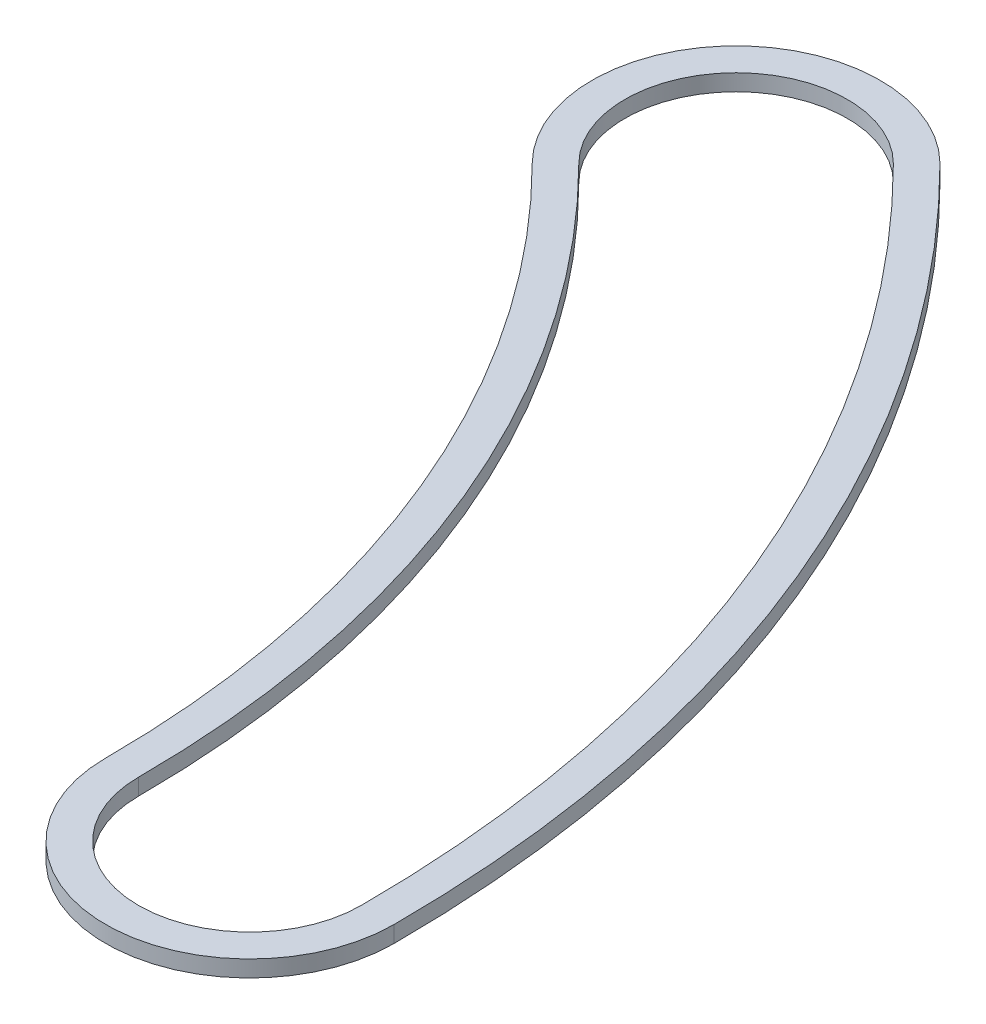
ISO-10303-21;
HEADER;
FILE_DESCRIPTION(('STEP AP214'),'2;1');
FILE_NAME('part.step','',(''),(''),'','','');
FILE_SCHEMA(('AUTOMOTIVE_DESIGN { 1 0 10303 214 1 1 1 1 }'));
ENDSEC;
DATA;
#1=APPLICATION_CONTEXT('core data for automotive mechanical design processes');
#2=APPLICATION_PROTOCOL_DEFINITION('international standard','automotive_design',2000,#1);
#3=PRODUCT_CONTEXT('',#1,'mechanical');
#4=PRODUCT('Part','Part','',(#3));
#5=PRODUCT_RELATED_PRODUCT_CATEGORY('part','',(#4));
#6=PRODUCT_DEFINITION_FORMATION('','',#4);
#7=PRODUCT_DEFINITION_CONTEXT('part definition',#1,'design');
#8=PRODUCT_DEFINITION('design','',#6,#7);
#9=PRODUCT_DEFINITION_SHAPE('','',#8);
#10=(LENGTH_UNIT() NAMED_UNIT(*) SI_UNIT(.MILLI.,.METRE.));
#11=(NAMED_UNIT(*) PLANE_ANGLE_UNIT() SI_UNIT($,.RADIAN.));
#12=(NAMED_UNIT(*) SI_UNIT($,.STERADIAN.) SOLID_ANGLE_UNIT());
#13=UNCERTAINTY_MEASURE_WITH_UNIT(LENGTH_MEASURE(1.E-05),#10,'distance_accuracy_value','');
#14=(GEOMETRIC_REPRESENTATION_CONTEXT(3) GLOBAL_UNCERTAINTY_ASSIGNED_CONTEXT((#13)) GLOBAL_UNIT_ASSIGNED_CONTEXT((#10,
#11,#12)) REPRESENTATION_CONTEXT('',''));
#15=CARTESIAN_POINT('',(0.,0.,0.));
#16=DIRECTION('',(0.,0.,1.));
#17=DIRECTION('',(1.,0.,0.));
#18=AXIS2_PLACEMENT_3D('',#15,#16,#17);
#19=CARTESIAN_POINT('',(18.0975,0.508,0.));
#20=DIRECTION('',(0.,1.,0.));
#21=DIRECTION('',(0.,0.,1.));
#22=AXIS2_PLACEMENT_3D('',#19,#20,#21);
#23=PLANE('',#22);
#24=CARTESIAN_POINT('',(36.195,0.508,0.));
#25=DIRECTION('',(0.,1.,0.));
#26=DIRECTION('',(0.,0.,1.));
#27=AXIS2_PLACEMENT_3D('',#24,#25,#26);
#28=CIRCLE('',#27,4.445);
#29=CARTESIAN_POINT('',(31.75,0.508,0.));
#30=VERTEX_POINT('',#29);
#31=CARTESIAN_POINT('',(40.64,0.508,0.));
#32=VERTEX_POINT('',#31);
#33=EDGE_CURVE('E133',#30,#32,#28,.T.);
#34=ORIENTED_EDGE('',*,*,#33,.T.);
#35=CARTESIAN_POINT('',(0.,0.508,0.));
#36=DIRECTION('',(0.,1.,0.));
#37=DIRECTION('',(0.,0.,1.));
#38=AXIS2_PLACEMENT_3D('',#35,#36,#37);
#39=CIRCLE('',#38,40.64);
#40=CARTESIAN_POINT('',(28.7368195874212,0.508,-28.7368195874213));
#41=VERTEX_POINT('',#40);
#42=EDGE_CURVE('E136',#32,#41,#39,.T.);
#43=ORIENTED_EDGE('',*,*,#42,.T.);
#44=CARTESIAN_POINT('',(25.593729945047,0.508,-25.5937299450471));
#45=DIRECTION('',(0.,1.,0.));
#46=DIRECTION('',(0.,0.,1.));
#47=AXIS2_PLACEMENT_3D('',#44,#45,#46);
#48=CIRCLE('',#47,4.445);
#49=CARTESIAN_POINT('',(22.4506403026728,0.508,-22.4506403026729));
#50=VERTEX_POINT('',#49);
#51=EDGE_CURVE('E139',#41,#50,#48,.T.);
#52=ORIENTED_EDGE('',*,*,#51,.T.);
#53=CARTESIAN_POINT('',(0.,0.508,0.));
#54=DIRECTION('',(0.,-1.,0.));
#55=DIRECTION('',(0.,0.,1.));
#56=AXIS2_PLACEMENT_3D('',#53,#54,#55);
#57=CIRCLE('',#56,31.75);
#58=EDGE_CURVE('E141',#50,#30,#57,.T.);
#59=ORIENTED_EDGE('',*,*,#58,.T.);
#60=EDGE_LOOP('',(#34,#43,#52,#59));
#61=FACE_BOUND('',#60,.T.);
#62=CARTESIAN_POINT('',(0.,0.508,0.));
#63=DIRECTION('',(0.,1.,0.));
#64=DIRECTION('',(0.,0.,1.));
#65=AXIS2_PLACEMENT_3D('',#62,#63,#64);
#66=CIRCLE('',#65,39.624);
#67=CARTESIAN_POINT('',(39.624,0.508,0.));
#68=VERTEX_POINT('',#67);
#69=CARTESIAN_POINT('',(28.0183990977357,0.508,-28.0183990977358));
#70=VERTEX_POINT('',#69);
#71=EDGE_CURVE('E105',#68,#70,#66,.T.);
#72=ORIENTED_EDGE('',*,*,#71,.F.);
#73=CARTESIAN_POINT('',(36.195,0.508,0.));
#74=DIRECTION('',(0.,1.,0.));
#75=DIRECTION('',(0.,0.,1.));
#76=AXIS2_PLACEMENT_3D('',#73,#74,#75);
#77=CIRCLE('',#76,3.429);
#78=CARTESIAN_POINT('',(32.766,0.508,0.));
#79=VERTEX_POINT('',#78);
#80=EDGE_CURVE('E97',#79,#68,#77,.T.);
#81=ORIENTED_EDGE('',*,*,#80,.F.);
#82=CARTESIAN_POINT('',(0.,0.508,0.));
#83=DIRECTION('',(0.,-1.,0.));
#84=DIRECTION('',(0.,0.,1.));
#85=AXIS2_PLACEMENT_3D('',#82,#83,#84);
#86=CIRCLE('',#85,32.766);
#87=CARTESIAN_POINT('',(23.1690607923584,0.508,-23.1690607923585));
#88=VERTEX_POINT('',#87);
#89=EDGE_CURVE('E119',#88,#79,#86,.T.);
#90=ORIENTED_EDGE('',*,*,#89,.F.);
#91=CARTESIAN_POINT('',(25.593729945047,0.508,-25.5937299450471));
#92=DIRECTION('',(0.,1.,0.));
#93=DIRECTION('',(0.,0.,1.));
#94=AXIS2_PLACEMENT_3D('',#91,#92,#93);
#95=CIRCLE('',#94,3.429);
#96=EDGE_CURVE('E117',#70,#88,#95,.T.);
#97=ORIENTED_EDGE('',*,*,#96,.F.);
#98=EDGE_LOOP('',(#72,#81,#90,#97));
#99=FACE_BOUND('',#98,.T.);
#100=ADVANCED_FACE('F32',(#61,#99),#23,.T.);
#101=CARTESIAN_POINT('',(18.0975,0.,0.));
#102=DIRECTION('',(0.,1.,0.));
#103=DIRECTION('',(0.,0.,1.));
#104=AXIS2_PLACEMENT_3D('',#101,#102,#103);
#105=PLANE('',#104);
#106=CARTESIAN_POINT('',(36.195,0.,0.));
#107=DIRECTION('',(0.,1.,0.));
#108=DIRECTION('',(0.,0.,1.));
#109=AXIS2_PLACEMENT_3D('',#106,#107,#108);
#110=CIRCLE('',#109,4.445);
#111=CARTESIAN_POINT('',(31.75,0.,0.));
#112=VERTEX_POINT('',#111);
#113=CARTESIAN_POINT('',(40.64,0.,0.));
#114=VERTEX_POINT('',#113);
#115=EDGE_CURVE('E113',#112,#114,#110,.T.);
#116=ORIENTED_EDGE('',*,*,#115,.F.);
#117=CARTESIAN_POINT('',(0.,0.,0.));
#118=DIRECTION('',(0.,-1.,0.));
#119=DIRECTION('',(0.,0.,1.));
#120=AXIS2_PLACEMENT_3D('',#117,#118,#119);
#121=CIRCLE('',#120,31.75);
#122=CARTESIAN_POINT('',(22.4506403026728,0.,-22.4506403026729));
#123=VERTEX_POINT('',#122);
#124=EDGE_CURVE('E137',#123,#112,#121,.T.);
#125=ORIENTED_EDGE('',*,*,#124,.F.);
#126=CARTESIAN_POINT('',(25.593729945047,0.,-25.5937299450471));
#127=DIRECTION('',(0.,1.,0.));
#128=DIRECTION('',(0.,0.,1.));
#129=AXIS2_PLACEMENT_3D('',#126,#127,#128);
#130=CIRCLE('',#129,4.445);
#131=CARTESIAN_POINT('',(28.7368195874212,0.,-28.7368195874213));
#132=VERTEX_POINT('',#131);
#133=EDGE_CURVE('E148',#132,#123,#130,.T.);
#134=ORIENTED_EDGE('',*,*,#133,.F.);
#135=CARTESIAN_POINT('',(0.,0.,0.));
#136=DIRECTION('',(0.,1.,0.));
#137=DIRECTION('',(0.,0.,1.));
#138=AXIS2_PLACEMENT_3D('',#135,#136,#137);
#139=CIRCLE('',#138,40.64);
#140=EDGE_CURVE('E146',#114,#132,#139,.T.);
#141=ORIENTED_EDGE('',*,*,#140,.F.);
#142=EDGE_LOOP('',(#116,#125,#134,#141));
#143=FACE_BOUND('',#142,.T.);
#144=CARTESIAN_POINT('',(36.195,0.,0.));
#145=DIRECTION('',(0.,1.,0.));
#146=DIRECTION('',(0.,0.,1.));
#147=AXIS2_PLACEMENT_3D('',#144,#145,#146);
#148=CIRCLE('',#147,3.429);
#149=CARTESIAN_POINT('',(32.766,0.,0.));
#150=VERTEX_POINT('',#149);
#151=CARTESIAN_POINT('',(39.624,0.,0.));
#152=VERTEX_POINT('',#151);
#153=EDGE_CURVE('E55',#150,#152,#148,.T.);
#154=ORIENTED_EDGE('',*,*,#153,.T.);
#155=CARTESIAN_POINT('',(0.,0.,0.));
#156=DIRECTION('',(0.,1.,0.));
#157=DIRECTION('',(0.,0.,1.));
#158=AXIS2_PLACEMENT_3D('',#155,#156,#157);
#159=CIRCLE('',#158,39.624);
#160=CARTESIAN_POINT('',(28.0183990977357,0.,-28.0183990977358));
#161=VERTEX_POINT('',#160);
#162=EDGE_CURVE('E112',#152,#161,#159,.T.);
#163=ORIENTED_EDGE('',*,*,#162,.T.);
#164=CARTESIAN_POINT('',(25.593729945047,0.,-25.5937299450471));
#165=DIRECTION('',(0.,1.,0.));
#166=DIRECTION('',(0.,0.,1.));
#167=AXIS2_PLACEMENT_3D('',#164,#165,#166);
#168=CIRCLE('',#167,3.429);
#169=CARTESIAN_POINT('',(23.1690607923584,0.,-23.1690607923585));
#170=VERTEX_POINT('',#169);
#171=EDGE_CURVE('E125',#161,#170,#168,.T.);
#172=ORIENTED_EDGE('',*,*,#171,.T.);
#173=CARTESIAN_POINT('',(0.,0.,0.));
#174=DIRECTION('',(0.,-1.,0.));
#175=DIRECTION('',(0.,0.,1.));
#176=AXIS2_PLACEMENT_3D('',#173,#174,#175);
#177=CIRCLE('',#176,32.766);
#178=EDGE_CURVE('E106',#170,#150,#177,.T.);
#179=ORIENTED_EDGE('',*,*,#178,.T.);
#180=EDGE_LOOP('',(#154,#163,#172,#179));
#181=FACE_BOUND('',#180,.T.);
#182=ADVANCED_FACE('F166',(#143,#181),#105,.F.);
#183=CARTESIAN_POINT('',(36.195,0.508,0.));
#184=DIRECTION('',(0.,-1.,0.));
#185=DIRECTION('',(0.,0.,-1.));
#186=AXIS2_PLACEMENT_3D('',#183,#184,#185);
#187=CYLINDRICAL_SURFACE('',#186,4.445);
#188=ORIENTED_EDGE('',*,*,#115,.T.);
#189=DIRECTION('',(0.,-1.,0.));
#190=VECTOR('',#189,1.);
#191=CARTESIAN_POINT('',(40.64,0.508,0.));
#192=LINE('',#191,#190);
#193=EDGE_CURVE('E11',#32,#114,#192,.T.);
#194=ORIENTED_EDGE('',*,*,#193,.F.);
#195=ORIENTED_EDGE('',*,*,#33,.F.);
#196=DIRECTION('',(0.,-1.,0.));
#197=VECTOR('',#196,1.);
#198=CARTESIAN_POINT('',(31.75,0.508,0.));
#199=LINE('',#198,#197);
#200=EDGE_CURVE('E143',#30,#112,#199,.T.);
#201=ORIENTED_EDGE('',*,*,#200,.T.);
#202=EDGE_LOOP('',(#188,#194,#195,#201));
#203=FACE_BOUND('',#202,.T.);
#204=ADVANCED_FACE('F34',(#203),#187,.T.);
#205=CARTESIAN_POINT('',(0.,0.508,0.));
#206=DIRECTION('',(0.,-1.,0.));
#207=DIRECTION('',(0.,0.,-1.));
#208=AXIS2_PLACEMENT_3D('',#205,#206,#207);
#209=CYLINDRICAL_SURFACE('',#208,40.64);
#210=ORIENTED_EDGE('',*,*,#140,.T.);
#211=DIRECTION('',(0.,-1.,0.));
#212=VECTOR('',#211,1.);
#213=CARTESIAN_POINT('',(28.7368195874212,0.508,-28.7368195874213));
#214=LINE('',#213,#212);
#215=EDGE_CURVE('E40',#41,#132,#214,.T.);
#216=ORIENTED_EDGE('',*,*,#215,.F.);
#217=ORIENTED_EDGE('',*,*,#42,.F.);
#218=ORIENTED_EDGE('',*,*,#193,.T.);
#219=EDGE_LOOP('',(#210,#216,#217,#218));
#220=FACE_BOUND('',#219,.T.);
#221=ADVANCED_FACE('F176',(#220),#209,.T.);
#222=CARTESIAN_POINT('',(25.593729945047,0.508,-25.5937299450471));
#223=DIRECTION('',(0.,-1.,0.));
#224=DIRECTION('',(0.,0.,-1.));
#225=AXIS2_PLACEMENT_3D('',#222,#223,#224);
#226=CYLINDRICAL_SURFACE('',#225,4.445);
#227=ORIENTED_EDGE('',*,*,#133,.T.);
#228=DIRECTION('',(0.,-1.,0.));
#229=VECTOR('',#228,1.);
#230=CARTESIAN_POINT('',(22.4506403026728,0.508,-22.4506403026729));
#231=LINE('',#230,#229);
#232=EDGE_CURVE('E153',#50,#123,#231,.T.);
#233=ORIENTED_EDGE('',*,*,#232,.F.);
#234=ORIENTED_EDGE('',*,*,#51,.F.);
#235=ORIENTED_EDGE('',*,*,#215,.T.);
#236=EDGE_LOOP('',(#227,#233,#234,#235));
#237=FACE_BOUND('',#236,.T.);
#238=ADVANCED_FACE('F160',(#237),#226,.T.);
#239=CARTESIAN_POINT('',(0.,0.508,0.));
#240=DIRECTION('',(0.,-1.,0.));
#241=DIRECTION('',(0.,0.,-1.));
#242=AXIS2_PLACEMENT_3D('',#239,#240,#241);
#243=CYLINDRICAL_SURFACE('',#242,31.75);
#244=ORIENTED_EDGE('',*,*,#124,.T.);
#245=ORIENTED_EDGE('',*,*,#200,.F.);
#246=ORIENTED_EDGE('',*,*,#58,.F.);
#247=ORIENTED_EDGE('',*,*,#232,.T.);
#248=EDGE_LOOP('',(#244,#245,#246,#247));
#249=FACE_BOUND('',#248,.T.);
#250=ADVANCED_FACE('F170',(#249),#243,.F.);
#251=CARTESIAN_POINT('',(36.195,0.508,0.));
#252=DIRECTION('',(0.,-1.,0.));
#253=DIRECTION('',(0.,0.,-1.));
#254=AXIS2_PLACEMENT_3D('',#251,#252,#253);
#255=CYLINDRICAL_SURFACE('',#254,3.429);
#256=ORIENTED_EDGE('',*,*,#153,.F.);
#257=DIRECTION('',(0.,-1.,0.));
#258=VECTOR('',#257,1.);
#259=CARTESIAN_POINT('',(32.766,0.508,0.));
#260=LINE('',#259,#258);
#261=EDGE_CURVE('E101',#79,#150,#260,.T.);
#262=ORIENTED_EDGE('',*,*,#261,.F.);
#263=ORIENTED_EDGE('',*,*,#80,.T.);
#264=DIRECTION('',(0.,-1.,0.));
#265=VECTOR('',#264,1.);
#266=CARTESIAN_POINT('',(39.624,0.508,0.));
#267=LINE('',#266,#265);
#268=EDGE_CURVE('E100',#68,#152,#267,.T.);
#269=ORIENTED_EDGE('',*,*,#268,.T.);
#270=EDGE_LOOP('',(#256,#262,#263,#269));
#271=FACE_BOUND('',#270,.T.);
#272=ADVANCED_FACE('F99',(#271),#255,.F.);
#273=CARTESIAN_POINT('',(0.,0.508,0.));
#274=DIRECTION('',(0.,-1.,0.));
#275=DIRECTION('',(0.,0.,-1.));
#276=AXIS2_PLACEMENT_3D('',#273,#274,#275);
#277=CYLINDRICAL_SURFACE('',#276,39.624);
#278=ORIENTED_EDGE('',*,*,#162,.F.);
#279=ORIENTED_EDGE('',*,*,#268,.F.);
#280=ORIENTED_EDGE('',*,*,#71,.T.);
#281=DIRECTION('',(0.,-1.,0.));
#282=VECTOR('',#281,1.);
#283=CARTESIAN_POINT('',(28.0183990977357,0.508,-28.0183990977358));
#284=LINE('',#283,#282);
#285=EDGE_CURVE('E114',#70,#161,#284,.T.);
#286=ORIENTED_EDGE('',*,*,#285,.T.);
#287=EDGE_LOOP('',(#278,#279,#280,#286));
#288=FACE_BOUND('',#287,.T.);
#289=ADVANCED_FACE('F109',(#288),#277,.F.);
#290=CARTESIAN_POINT('',(25.593729945047,0.508,-25.5937299450471));
#291=DIRECTION('',(0.,-1.,0.));
#292=DIRECTION('',(0.,0.,-1.));
#293=AXIS2_PLACEMENT_3D('',#290,#291,#292);
#294=CYLINDRICAL_SURFACE('',#293,3.429);
#295=ORIENTED_EDGE('',*,*,#171,.F.);
#296=ORIENTED_EDGE('',*,*,#285,.F.);
#297=ORIENTED_EDGE('',*,*,#96,.T.);
#298=DIRECTION('',(0.,-1.,0.));
#299=VECTOR('',#298,1.);
#300=CARTESIAN_POINT('',(23.1690607923584,0.508,-23.1690607923585));
#301=LINE('',#300,#299);
#302=EDGE_CURVE('E47',#88,#170,#301,.T.);
#303=ORIENTED_EDGE('',*,*,#302,.T.);
#304=EDGE_LOOP('',(#295,#296,#297,#303));
#305=FACE_BOUND('',#304,.T.);
#306=ADVANCED_FACE('F199',(#305),#294,.F.);
#307=CARTESIAN_POINT('',(0.,0.508,0.));
#308=DIRECTION('',(0.,-1.,0.));
#309=DIRECTION('',(0.,0.,-1.));
#310=AXIS2_PLACEMENT_3D('',#307,#308,#309);
#311=CYLINDRICAL_SURFACE('',#310,32.766);
#312=ORIENTED_EDGE('',*,*,#178,.F.);
#313=ORIENTED_EDGE('',*,*,#302,.F.);
#314=ORIENTED_EDGE('',*,*,#89,.T.);
#315=ORIENTED_EDGE('',*,*,#261,.T.);
#316=EDGE_LOOP('',(#312,#313,#314,#315));
#317=FACE_BOUND('',#316,.T.);
#318=ADVANCED_FACE('F203',(#317),#311,.T.);
#319=CLOSED_SHELL('',(#100,#182,#204,#221,#238,#250,#272,#289,#306,#318));
#320=MANIFOLD_SOLID_BREP('B2',#319);
#321=ADVANCED_BREP_SHAPE_REPRESENTATION('',(#18,#320),#14);
#322=SHAPE_DEFINITION_REPRESENTATION(#9,#321);
ENDSEC;
END-ISO-10303-21;
